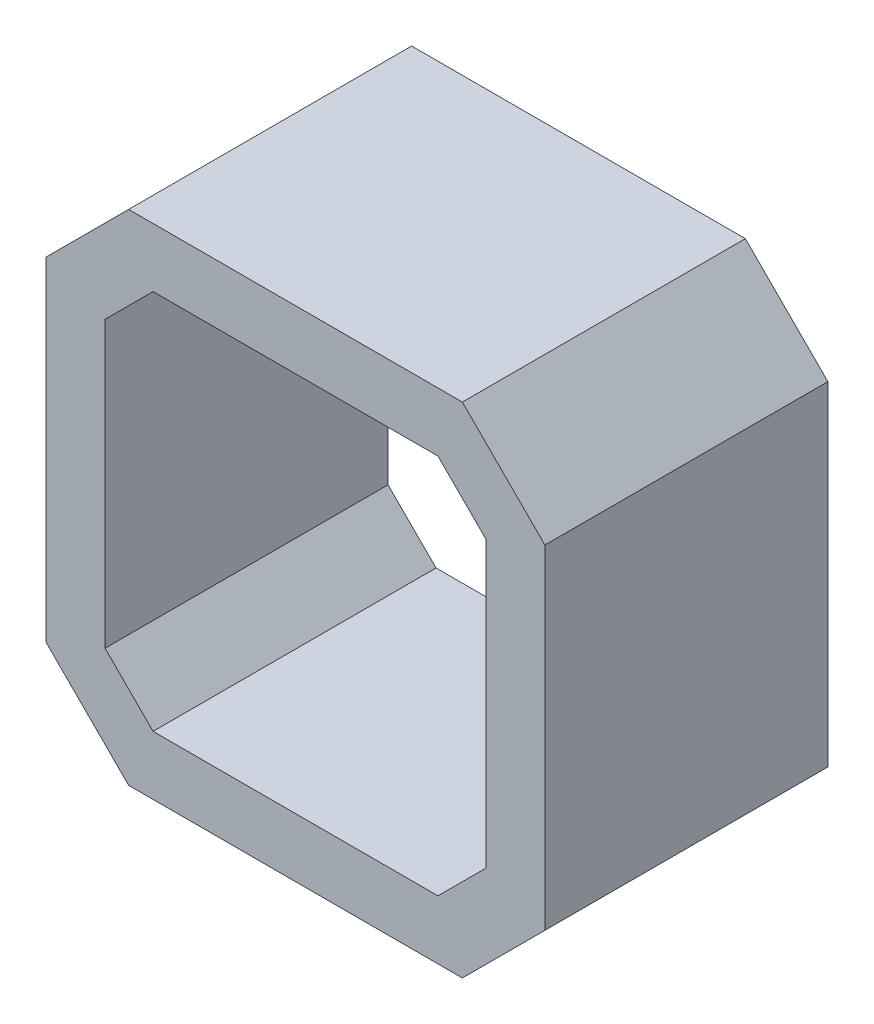
ISO-10303-21;
HEADER;
FILE_DESCRIPTION(('STEP AP214'),'2;1');
FILE_NAME('part.step','',(''),(''),'','','');
FILE_SCHEMA(('AUTOMOTIVE_DESIGN { 1 0 10303 214 1 1 1 1 }'));
ENDSEC;
DATA;
#1=APPLICATION_CONTEXT('core data for automotive mechanical design processes');
#2=APPLICATION_PROTOCOL_DEFINITION('international standard','automotive_design',2000,#1);
#3=PRODUCT_CONTEXT('',#1,'mechanical');
#4=PRODUCT('Part','Part','',(#3));
#5=PRODUCT_RELATED_PRODUCT_CATEGORY('part','',(#4));
#6=PRODUCT_DEFINITION_FORMATION('','',#4);
#7=PRODUCT_DEFINITION_CONTEXT('part definition',#1,'design');
#8=PRODUCT_DEFINITION('design','',#6,#7);
#9=PRODUCT_DEFINITION_SHAPE('','',#8);
#10=(LENGTH_UNIT() NAMED_UNIT(*) SI_UNIT(.MILLI.,.METRE.));
#11=(NAMED_UNIT(*) PLANE_ANGLE_UNIT() SI_UNIT($,.RADIAN.));
#12=(NAMED_UNIT(*) SI_UNIT($,.STERADIAN.) SOLID_ANGLE_UNIT());
#13=UNCERTAINTY_MEASURE_WITH_UNIT(LENGTH_MEASURE(1.E-05),#10,'distance_accuracy_value','');
#14=(GEOMETRIC_REPRESENTATION_CONTEXT(3) GLOBAL_UNCERTAINTY_ASSIGNED_CONTEXT((#13)) GLOBAL_UNIT_ASSIGNED_CONTEXT((#10,
#11,#12)) REPRESENTATION_CONTEXT('',''));
#15=CARTESIAN_POINT('',(0.,0.,0.));
#16=DIRECTION('',(0.,0.,1.));
#17=DIRECTION('',(1.,0.,0.));
#18=AXIS2_PLACEMENT_3D('',#15,#16,#17);
#19=CARTESIAN_POINT('',(0.,0.,12.));
#20=DIRECTION('',(0.,0.,-1.));
#21=DIRECTION('',(-1.,0.,0.));
#22=AXIS2_PLACEMENT_3D('',#19,#20,#21);
#23=PLANE('',#22);
#24=DIRECTION('',(-1.,0.,0.));
#25=VECTOR('',#24,1.);
#26=CARTESIAN_POINT('',(-14.15,21.15,12.));
#27=LINE('',#26,#25);
#28=CARTESIAN_POINT('',(14.15,21.15,12.));
#29=VERTEX_POINT('',#28);
#30=CARTESIAN_POINT('',(-14.15,21.15,12.));
#31=VERTEX_POINT('',#30);
#32=EDGE_CURVE('E210',#29,#31,#27,.T.);
#33=ORIENTED_EDGE('',*,*,#32,.T.);
#34=DIRECTION('',(-0.707106781186547,-0.707106781186547,0.));
#35=VECTOR('',#34,1.);
#36=CARTESIAN_POINT('',(-21.15,14.15,12.));
#37=LINE('',#36,#35);
#38=CARTESIAN_POINT('',(-21.15,14.15,12.));
#39=VERTEX_POINT('',#38);
#40=EDGE_CURVE('E213',#31,#39,#37,.T.);
#41=ORIENTED_EDGE('',*,*,#40,.T.);
#42=DIRECTION('',(0.,-1.,0.));
#43=VECTOR('',#42,1.);
#44=CARTESIAN_POINT('',(-21.15,14.15,12.));
#45=LINE('',#44,#43);
#46=CARTESIAN_POINT('',(-21.15,-14.15,12.));
#47=VERTEX_POINT('',#46);
#48=EDGE_CURVE('E216',#39,#47,#45,.T.);
#49=ORIENTED_EDGE('',*,*,#48,.T.);
#50=DIRECTION('',(0.707106781186547,-0.707106781186547,0.));
#51=VECTOR('',#50,1.);
#52=CARTESIAN_POINT('',(-21.15,-14.15,12.));
#53=LINE('',#52,#51);
#54=CARTESIAN_POINT('',(-14.15,-21.15,12.));
#55=VERTEX_POINT('',#54);
#56=EDGE_CURVE('E218',#47,#55,#53,.T.);
#57=ORIENTED_EDGE('',*,*,#56,.T.);
#58=DIRECTION('',(1.,0.,0.));
#59=VECTOR('',#58,1.);
#60=CARTESIAN_POINT('',(-14.15,-21.15,12.));
#61=LINE('',#60,#59);
#62=CARTESIAN_POINT('',(14.15,-21.15,12.));
#63=VERTEX_POINT('',#62);
#64=EDGE_CURVE('E220',#55,#63,#61,.T.);
#65=ORIENTED_EDGE('',*,*,#64,.T.);
#66=DIRECTION('',(0.707106781186547,0.707106781186547,0.));
#67=VECTOR('',#66,1.);
#68=CARTESIAN_POINT('',(14.15,-21.15,12.));
#69=LINE('',#68,#67);
#70=CARTESIAN_POINT('',(21.15,-14.15,12.));
#71=VERTEX_POINT('',#70);
#72=EDGE_CURVE('E222',#63,#71,#69,.T.);
#73=ORIENTED_EDGE('',*,*,#72,.T.);
#74=DIRECTION('',(0.,1.,0.));
#75=VECTOR('',#74,1.);
#76=CARTESIAN_POINT('',(21.15,14.15,12.));
#77=LINE('',#76,#75);
#78=CARTESIAN_POINT('',(21.15,14.15,12.));
#79=VERTEX_POINT('',#78);
#80=EDGE_CURVE('E224',#71,#79,#77,.T.);
#81=ORIENTED_EDGE('',*,*,#80,.T.);
#82=DIRECTION('',(-0.707106781186547,0.707106781186547,0.));
#83=VECTOR('',#82,1.);
#84=CARTESIAN_POINT('',(14.15,21.15,12.));
#85=LINE('',#84,#83);
#86=EDGE_CURVE('E226',#79,#29,#85,.T.);
#87=ORIENTED_EDGE('',*,*,#86,.T.);
#88=EDGE_LOOP('',(#33,#41,#49,#57,#65,#73,#81,#87));
#89=FACE_BOUND('',#88,.T.);
#90=DIRECTION('',(0.,-1.,0.));
#91=VECTOR('',#90,1.);
#92=CARTESIAN_POINT('',(-16.15,12.0789321881345,12.));
#93=LINE('',#92,#91);
#94=CARTESIAN_POINT('',(-16.15,12.0789321881345,12.));
#95=VERTEX_POINT('',#94);
#96=CARTESIAN_POINT('',(-16.15,-12.0789321881345,12.));
#97=VERTEX_POINT('',#96);
#98=EDGE_CURVE('E145',#95,#97,#93,.T.);
#99=ORIENTED_EDGE('',*,*,#98,.F.);
#100=DIRECTION('',(-0.707106781186547,-0.707106781186547,0.));
#101=VECTOR('',#100,1.);
#102=CARTESIAN_POINT('',(-16.15,12.0789321881345,12.));
#103=LINE('',#102,#101);
#104=CARTESIAN_POINT('',(-12.0789321881345,16.15,12.));
#105=VERTEX_POINT('',#104);
#106=EDGE_CURVE('E178',#105,#95,#103,.T.);
#107=ORIENTED_EDGE('',*,*,#106,.F.);
#108=DIRECTION('',(-1.,0.,0.));
#109=VECTOR('',#108,1.);
#110=CARTESIAN_POINT('',(-12.0789321881345,16.15,12.));
#111=LINE('',#110,#109);
#112=CARTESIAN_POINT('',(12.0789321881345,16.15,12.));
#113=VERTEX_POINT('',#112);
#114=EDGE_CURVE('E176',#113,#105,#111,.T.);
#115=ORIENTED_EDGE('',*,*,#114,.F.);
#116=DIRECTION('',(-0.707106781186547,0.707106781186547,0.));
#117=VECTOR('',#116,1.);
#118=CARTESIAN_POINT('',(12.0789321881345,16.15,12.));
#119=LINE('',#118,#117);
#120=CARTESIAN_POINT('',(16.15,12.0789321881345,12.));
#121=VERTEX_POINT('',#120);
#122=EDGE_CURVE('E174',#121,#113,#119,.T.);
#123=ORIENTED_EDGE('',*,*,#122,.F.);
#124=DIRECTION('',(0.,1.,0.));
#125=VECTOR('',#124,1.);
#126=CARTESIAN_POINT('',(16.15,12.0789321881345,12.));
#127=LINE('',#126,#125);
#128=CARTESIAN_POINT('',(16.15,-12.0789321881345,12.));
#129=VERTEX_POINT('',#128);
#130=EDGE_CURVE('E172',#129,#121,#127,.T.);
#131=ORIENTED_EDGE('',*,*,#130,.F.);
#132=DIRECTION('',(0.707106781186547,0.707106781186547,0.));
#133=VECTOR('',#132,1.);
#134=CARTESIAN_POINT('',(12.0789321881345,-16.15,12.));
#135=LINE('',#134,#133);
#136=CARTESIAN_POINT('',(12.0789321881345,-16.15,12.));
#137=VERTEX_POINT('',#136);
#138=EDGE_CURVE('E168',#137,#129,#135,.T.);
#139=ORIENTED_EDGE('',*,*,#138,.F.);
#140=DIRECTION('',(1.,0.,0.));
#141=VECTOR('',#140,1.);
#142=CARTESIAN_POINT('',(-12.0789321881345,-16.15,12.));
#143=LINE('',#142,#141);
#144=CARTESIAN_POINT('',(-12.0789321881345,-16.15,12.));
#145=VERTEX_POINT('',#144);
#146=EDGE_CURVE('E166',#145,#137,#143,.T.);
#147=ORIENTED_EDGE('',*,*,#146,.F.);
#148=DIRECTION('',(0.707106781186548,-0.707106781186547,0.));
#149=VECTOR('',#148,1.);
#150=CARTESIAN_POINT('',(-16.15,-12.0789321881345,12.));
#151=LINE('',#150,#149);
#152=EDGE_CURVE('E153',#97,#145,#151,.T.);
#153=ORIENTED_EDGE('',*,*,#152,.F.);
#154=EDGE_LOOP('',(#99,#107,#115,#123,#131,#139,#147,#153));
#155=FACE_BOUND('',#154,.T.);
#156=ADVANCED_FACE('F32',(#89,#155),#23,.F.);
#157=CARTESIAN_POINT('',(0.,0.,-12.));
#158=DIRECTION('',(0.,0.,-1.));
#159=DIRECTION('',(-1.,0.,0.));
#160=AXIS2_PLACEMENT_3D('',#157,#158,#159);
#161=PLANE('',#160);
#162=DIRECTION('',(-1.,0.,0.));
#163=VECTOR('',#162,1.);
#164=CARTESIAN_POINT('',(-14.15,21.15,-12.));
#165=LINE('',#164,#163);
#166=CARTESIAN_POINT('',(14.15,21.15,-12.));
#167=VERTEX_POINT('',#166);
#168=CARTESIAN_POINT('',(-14.15,21.15,-12.));
#169=VERTEX_POINT('',#168);
#170=EDGE_CURVE('E161',#167,#169,#165,.T.);
#171=ORIENTED_EDGE('',*,*,#170,.F.);
#172=DIRECTION('',(-0.707106781186547,0.707106781186547,0.));
#173=VECTOR('',#172,1.);
#174=CARTESIAN_POINT('',(14.15,21.15,-12.));
#175=LINE('',#174,#173);
#176=CARTESIAN_POINT('',(21.15,14.15,-12.));
#177=VERTEX_POINT('',#176);
#178=EDGE_CURVE('E214',#177,#167,#175,.T.);
#179=ORIENTED_EDGE('',*,*,#178,.F.);
#180=DIRECTION('',(0.,1.,0.));
#181=VECTOR('',#180,1.);
#182=CARTESIAN_POINT('',(21.15,14.15,-12.));
#183=LINE('',#182,#181);
#184=CARTESIAN_POINT('',(21.15,-14.15,-12.));
#185=VERTEX_POINT('',#184);
#186=EDGE_CURVE('E241',#185,#177,#183,.T.);
#187=ORIENTED_EDGE('',*,*,#186,.F.);
#188=DIRECTION('',(0.707106781186547,0.707106781186547,0.));
#189=VECTOR('',#188,1.);
#190=CARTESIAN_POINT('',(14.15,-21.15,-12.));
#191=LINE('',#190,#189);
#192=CARTESIAN_POINT('',(14.15,-21.15,-12.));
#193=VERTEX_POINT('',#192);
#194=EDGE_CURVE('E239',#193,#185,#191,.T.);
#195=ORIENTED_EDGE('',*,*,#194,.F.);
#196=DIRECTION('',(1.,0.,0.));
#197=VECTOR('',#196,1.);
#198=CARTESIAN_POINT('',(-14.15,-21.15,-12.));
#199=LINE('',#198,#197);
#200=CARTESIAN_POINT('',(-14.15,-21.15,-12.));
#201=VERTEX_POINT('',#200);
#202=EDGE_CURVE('E237',#201,#193,#199,.T.);
#203=ORIENTED_EDGE('',*,*,#202,.F.);
#204=DIRECTION('',(0.707106781186547,-0.707106781186547,0.));
#205=VECTOR('',#204,1.);
#206=CARTESIAN_POINT('',(-21.15,-14.15,-12.));
#207=LINE('',#206,#205);
#208=CARTESIAN_POINT('',(-21.15,-14.15,-12.));
#209=VERTEX_POINT('',#208);
#210=EDGE_CURVE('E235',#209,#201,#207,.T.);
#211=ORIENTED_EDGE('',*,*,#210,.F.);
#212=DIRECTION('',(0.,-1.,0.));
#213=VECTOR('',#212,1.);
#214=CARTESIAN_POINT('',(-21.15,14.15,-12.));
#215=LINE('',#214,#213);
#216=CARTESIAN_POINT('',(-21.15,14.15,-12.));
#217=VERTEX_POINT('',#216);
#218=EDGE_CURVE('E233',#217,#209,#215,.T.);
#219=ORIENTED_EDGE('',*,*,#218,.F.);
#220=DIRECTION('',(-0.707106781186547,-0.707106781186547,0.));
#221=VECTOR('',#220,1.);
#222=CARTESIAN_POINT('',(-21.15,14.15,-12.));
#223=LINE('',#222,#221);
#224=EDGE_CURVE('E231',#169,#217,#223,.T.);
#225=ORIENTED_EDGE('',*,*,#224,.F.);
#226=EDGE_LOOP('',(#171,#179,#187,#195,#203,#211,#219,#225));
#227=FACE_BOUND('',#226,.T.);
#228=DIRECTION('',(-0.707106781186547,-0.707106781186547,0.));
#229=VECTOR('',#228,1.);
#230=CARTESIAN_POINT('',(-16.15,12.0789321881345,-12.));
#231=LINE('',#230,#229);
#232=CARTESIAN_POINT('',(-12.0789321881345,16.15,-12.));
#233=VERTEX_POINT('',#232);
#234=CARTESIAN_POINT('',(-16.15,12.0789321881345,-12.));
#235=VERTEX_POINT('',#234);
#236=EDGE_CURVE('E154',#233,#235,#231,.T.);
#237=ORIENTED_EDGE('',*,*,#236,.T.);
#238=DIRECTION('',(0.,-1.,0.));
#239=VECTOR('',#238,1.);
#240=CARTESIAN_POINT('',(-16.15,12.0789321881345,-12.));
#241=LINE('',#240,#239);
#242=CARTESIAN_POINT('',(-16.15,-12.0789321881345,-12.));
#243=VERTEX_POINT('',#242);
#244=EDGE_CURVE('E55',#235,#243,#241,.T.);
#245=ORIENTED_EDGE('',*,*,#244,.T.);
#246=DIRECTION('',(0.707106781186548,-0.707106781186547,0.));
#247=VECTOR('',#246,1.);
#248=CARTESIAN_POINT('',(-16.15,-12.0789321881345,-12.));
#249=LINE('',#248,#247);
#250=CARTESIAN_POINT('',(-12.0789321881345,-16.15,-12.));
#251=VERTEX_POINT('',#250);
#252=EDGE_CURVE('E160',#243,#251,#249,.T.);
#253=ORIENTED_EDGE('',*,*,#252,.T.);
#254=DIRECTION('',(1.,0.,0.));
#255=VECTOR('',#254,1.);
#256=CARTESIAN_POINT('',(-12.0789321881345,-16.15,-12.));
#257=LINE('',#256,#255);
#258=CARTESIAN_POINT('',(12.0789321881345,-16.15,-12.));
#259=VERTEX_POINT('',#258);
#260=EDGE_CURVE('E182',#251,#259,#257,.T.);
#261=ORIENTED_EDGE('',*,*,#260,.T.);
#262=DIRECTION('',(0.707106781186547,0.707106781186547,0.));
#263=VECTOR('',#262,1.);
#264=CARTESIAN_POINT('',(12.0789321881345,-16.15,-12.));
#265=LINE('',#264,#263);
#266=CARTESIAN_POINT('',(16.15,-12.0789321881345,-12.));
#267=VERTEX_POINT('',#266);
#268=EDGE_CURVE('E185',#259,#267,#265,.T.);
#269=ORIENTED_EDGE('',*,*,#268,.T.);
#270=DIRECTION('',(0.,1.,0.));
#271=VECTOR('',#270,1.);
#272=CARTESIAN_POINT('',(16.15,12.0789321881345,-12.));
#273=LINE('',#272,#271);
#274=CARTESIAN_POINT('',(16.15,12.0789321881345,-12.));
#275=VERTEX_POINT('',#274);
#276=EDGE_CURVE('E188',#267,#275,#273,.T.);
#277=ORIENTED_EDGE('',*,*,#276,.T.);
#278=DIRECTION('',(-0.707106781186547,0.707106781186547,0.));
#279=VECTOR('',#278,1.);
#280=CARTESIAN_POINT('',(12.0789321881345,16.15,-12.));
#281=LINE('',#280,#279);
#282=CARTESIAN_POINT('',(12.0789321881345,16.15,-12.));
#283=VERTEX_POINT('',#282);
#284=EDGE_CURVE('E191',#275,#283,#281,.T.);
#285=ORIENTED_EDGE('',*,*,#284,.T.);
#286=DIRECTION('',(-1.,0.,0.));
#287=VECTOR('',#286,1.);
#288=CARTESIAN_POINT('',(-12.0789321881345,16.15,-12.));
#289=LINE('',#288,#287);
#290=EDGE_CURVE('E194',#283,#233,#289,.T.);
#291=ORIENTED_EDGE('',*,*,#290,.T.);
#292=EDGE_LOOP('',(#237,#245,#253,#261,#269,#277,#285,#291));
#293=FACE_BOUND('',#292,.T.);
#294=ADVANCED_FACE('F271',(#227,#293),#161,.T.);
#295=CARTESIAN_POINT('',(-14.15,21.15,12.));
#296=DIRECTION('',(0.,-1.,0.));
#297=DIRECTION('',(0.,0.,-1.));
#298=AXIS2_PLACEMENT_3D('',#295,#296,#297);
#299=PLANE('',#298);
#300=ORIENTED_EDGE('',*,*,#170,.T.);
#301=DIRECTION('',(0.,0.,-1.));
#302=VECTOR('',#301,1.);
#303=CARTESIAN_POINT('',(-14.15,21.15,12.));
#304=LINE('',#303,#302);
#305=EDGE_CURVE('E11',#31,#169,#304,.T.);
#306=ORIENTED_EDGE('',*,*,#305,.F.);
#307=ORIENTED_EDGE('',*,*,#32,.F.);
#308=DIRECTION('',(0.,0.,-1.));
#309=VECTOR('',#308,1.);
#310=CARTESIAN_POINT('',(14.15,21.15,12.));
#311=LINE('',#310,#309);
#312=EDGE_CURVE('E228',#29,#167,#311,.T.);
#313=ORIENTED_EDGE('',*,*,#312,.T.);
#314=EDGE_LOOP('',(#300,#306,#307,#313));
#315=FACE_BOUND('',#314,.T.);
#316=ADVANCED_FACE('F34',(#315),#299,.F.);
#317=CARTESIAN_POINT('',(-21.15,14.15,12.));
#318=DIRECTION('',(0.707106781186548,-0.707106781186548,0.));
#319=DIRECTION('',(0.707106781186548,0.707106781186548,0.));
#320=AXIS2_PLACEMENT_3D('',#317,#318,#319);
#321=PLANE('',#320);
#322=ORIENTED_EDGE('',*,*,#224,.T.);
#323=DIRECTION('',(0.,0.,-1.));
#324=VECTOR('',#323,1.);
#325=CARTESIAN_POINT('',(-21.15,14.15,12.));
#326=LINE('',#325,#324);
#327=EDGE_CURVE('E40',#39,#217,#326,.T.);
#328=ORIENTED_EDGE('',*,*,#327,.F.);
#329=ORIENTED_EDGE('',*,*,#40,.F.);
#330=ORIENTED_EDGE('',*,*,#305,.T.);
#331=EDGE_LOOP('',(#322,#328,#329,#330));
#332=FACE_BOUND('',#331,.T.);
#333=ADVANCED_FACE('F288',(#332),#321,.F.);
#334=CARTESIAN_POINT('',(-21.15,14.15,12.));
#335=DIRECTION('',(1.,0.,0.));
#336=DIRECTION('',(0.,1.,0.));
#337=AXIS2_PLACEMENT_3D('',#334,#335,#336);
#338=PLANE('',#337);
#339=ORIENTED_EDGE('',*,*,#218,.T.);
#340=DIRECTION('',(0.,0.,-1.));
#341=VECTOR('',#340,1.);
#342=CARTESIAN_POINT('',(-21.15,-14.15,12.));
#343=LINE('',#342,#341);
#344=EDGE_CURVE('E258',#47,#209,#343,.T.);
#345=ORIENTED_EDGE('',*,*,#344,.F.);
#346=ORIENTED_EDGE('',*,*,#48,.F.);
#347=ORIENTED_EDGE('',*,*,#327,.T.);
#348=EDGE_LOOP('',(#339,#345,#346,#347));
#349=FACE_BOUND('',#348,.T.);
#350=ADVANCED_FACE('F265',(#349),#338,.F.);
#351=CARTESIAN_POINT('',(-21.15,-14.15,12.));
#352=DIRECTION('',(0.707106781186548,0.707106781186548,0.));
#353=DIRECTION('',(-0.707106781186548,0.707106781186548,0.));
#354=AXIS2_PLACEMENT_3D('',#351,#352,#353);
#355=PLANE('',#354);
#356=ORIENTED_EDGE('',*,*,#210,.T.);
#357=DIRECTION('',(0.,0.,-1.));
#358=VECTOR('',#357,1.);
#359=CARTESIAN_POINT('',(-14.15,-21.15,12.));
#360=LINE('',#359,#358);
#361=EDGE_CURVE('E255',#55,#201,#360,.T.);
#362=ORIENTED_EDGE('',*,*,#361,.F.);
#363=ORIENTED_EDGE('',*,*,#56,.F.);
#364=ORIENTED_EDGE('',*,*,#344,.T.);
#365=EDGE_LOOP('',(#356,#362,#363,#364));
#366=FACE_BOUND('',#365,.T.);
#367=ADVANCED_FACE('F277',(#366),#355,.F.);
#368=CARTESIAN_POINT('',(-14.15,-21.15,12.));
#369=DIRECTION('',(0.,1.,0.));
#370=DIRECTION('',(0.,0.,1.));
#371=AXIS2_PLACEMENT_3D('',#368,#369,#370);
#372=PLANE('',#371);
#373=ORIENTED_EDGE('',*,*,#202,.T.);
#374=DIRECTION('',(0.,0.,-1.));
#375=VECTOR('',#374,1.);
#376=CARTESIAN_POINT('',(14.15,-21.15,12.));
#377=LINE('',#376,#375);
#378=EDGE_CURVE('E252',#63,#193,#377,.T.);
#379=ORIENTED_EDGE('',*,*,#378,.F.);
#380=ORIENTED_EDGE('',*,*,#64,.F.);
#381=ORIENTED_EDGE('',*,*,#361,.T.);
#382=EDGE_LOOP('',(#373,#379,#380,#381));
#383=FACE_BOUND('',#382,.T.);
#384=ADVANCED_FACE('F281',(#383),#372,.F.);
#385=CARTESIAN_POINT('',(14.15,-21.15,12.));
#386=DIRECTION('',(-0.707106781186548,0.707106781186548,0.));
#387=DIRECTION('',(-0.707106781186548,-0.707106781186548,0.));
#388=AXIS2_PLACEMENT_3D('',#385,#386,#387);
#389=PLANE('',#388);
#390=ORIENTED_EDGE('',*,*,#194,.T.);
#391=DIRECTION('',(0.,0.,-1.));
#392=VECTOR('',#391,1.);
#393=CARTESIAN_POINT('',(21.15,-14.15,12.));
#394=LINE('',#393,#392);
#395=EDGE_CURVE('E249',#71,#185,#394,.T.);
#396=ORIENTED_EDGE('',*,*,#395,.F.);
#397=ORIENTED_EDGE('',*,*,#72,.F.);
#398=ORIENTED_EDGE('',*,*,#378,.T.);
#399=EDGE_LOOP('',(#390,#396,#397,#398));
#400=FACE_BOUND('',#399,.T.);
#401=ADVANCED_FACE('F301',(#400),#389,.F.);
#402=CARTESIAN_POINT('',(21.15,14.15,12.));
#403=DIRECTION('',(-1.,0.,0.));
#404=DIRECTION('',(0.,-1.,0.));
#405=AXIS2_PLACEMENT_3D('',#402,#403,#404);
#406=PLANE('',#405);
#407=ORIENTED_EDGE('',*,*,#186,.T.);
#408=DIRECTION('',(0.,0.,-1.));
#409=VECTOR('',#408,1.);
#410=CARTESIAN_POINT('',(21.15,14.15,12.));
#411=LINE('',#410,#409);
#412=EDGE_CURVE('E246',#79,#177,#411,.T.);
#413=ORIENTED_EDGE('',*,*,#412,.F.);
#414=ORIENTED_EDGE('',*,*,#80,.F.);
#415=ORIENTED_EDGE('',*,*,#395,.T.);
#416=EDGE_LOOP('',(#407,#413,#414,#415));
#417=FACE_BOUND('',#416,.T.);
#418=ADVANCED_FACE('F299',(#417),#406,.F.);
#419=CARTESIAN_POINT('',(14.15,21.15,12.));
#420=DIRECTION('',(-0.707106781186548,-0.707106781186548,0.));
#421=DIRECTION('',(0.707106781186548,-0.707106781186548,0.));
#422=AXIS2_PLACEMENT_3D('',#419,#420,#421);
#423=PLANE('',#422);
#424=ORIENTED_EDGE('',*,*,#178,.T.);
#425=ORIENTED_EDGE('',*,*,#312,.F.);
#426=ORIENTED_EDGE('',*,*,#86,.F.);
#427=ORIENTED_EDGE('',*,*,#412,.T.);
#428=EDGE_LOOP('',(#424,#425,#426,#427));
#429=FACE_BOUND('',#428,.T.);
#430=ADVANCED_FACE('F294',(#429),#423,.F.);
#431=CARTESIAN_POINT('',(-16.15,12.0789321881345,12.));
#432=DIRECTION('',(1.,0.,0.));
#433=DIRECTION('',(0.,0.,-1.));
#434=AXIS2_PLACEMENT_3D('',#431,#432,#433);
#435=PLANE('',#434);
#436=ORIENTED_EDGE('',*,*,#244,.F.);
#437=DIRECTION('',(0.,0.,-1.));
#438=VECTOR('',#437,1.);
#439=CARTESIAN_POINT('',(-16.15,12.0789321881345,12.));
#440=LINE('',#439,#438);
#441=EDGE_CURVE('E149',#95,#235,#440,.T.);
#442=ORIENTED_EDGE('',*,*,#441,.F.);
#443=ORIENTED_EDGE('',*,*,#98,.T.);
#444=DIRECTION('',(0.,0.,-1.));
#445=VECTOR('',#444,1.);
#446=CARTESIAN_POINT('',(-16.15,-12.0789321881345,12.));
#447=LINE('',#446,#445);
#448=EDGE_CURVE('E148',#97,#243,#447,.T.);
#449=ORIENTED_EDGE('',*,*,#448,.T.);
#450=EDGE_LOOP('',(#436,#442,#443,#449));
#451=FACE_BOUND('',#450,.T.);
#452=ADVANCED_FACE('F147',(#451),#435,.T.);
#453=CARTESIAN_POINT('',(-16.15,-12.0789321881345,12.));
#454=DIRECTION('',(0.707106781186547,0.707106781186548,0.));
#455=DIRECTION('',(-0.707106781186548,0.707106781186547,0.));
#456=AXIS2_PLACEMENT_3D('',#453,#454,#455);
#457=PLANE('',#456);
#458=ORIENTED_EDGE('',*,*,#252,.F.);
#459=ORIENTED_EDGE('',*,*,#448,.F.);
#460=ORIENTED_EDGE('',*,*,#152,.T.);
#461=DIRECTION('',(0.,0.,-1.));
#462=VECTOR('',#461,1.);
#463=CARTESIAN_POINT('',(-12.0789321881345,-16.15,12.));
#464=LINE('',#463,#462);
#465=EDGE_CURVE('E162',#145,#251,#464,.T.);
#466=ORIENTED_EDGE('',*,*,#465,.T.);
#467=EDGE_LOOP('',(#458,#459,#460,#466));
#468=FACE_BOUND('',#467,.T.);
#469=ADVANCED_FACE('F157',(#468),#457,.T.);
#470=CARTESIAN_POINT('',(-12.0789321881345,-16.15,12.));
#471=DIRECTION('',(0.,1.,0.));
#472=DIRECTION('',(0.,0.,1.));
#473=AXIS2_PLACEMENT_3D('',#470,#471,#472);
#474=PLANE('',#473);
#475=ORIENTED_EDGE('',*,*,#260,.F.);
#476=ORIENTED_EDGE('',*,*,#465,.F.);
#477=ORIENTED_EDGE('',*,*,#146,.T.);
#478=DIRECTION('',(0.,0.,-1.));
#479=VECTOR('',#478,1.);
#480=CARTESIAN_POINT('',(12.0789321881345,-16.15,12.));
#481=LINE('',#480,#479);
#482=EDGE_CURVE('E207',#137,#259,#481,.T.);
#483=ORIENTED_EDGE('',*,*,#482,.T.);
#484=EDGE_LOOP('',(#475,#476,#477,#483));
#485=FACE_BOUND('',#484,.T.);
#486=ADVANCED_FACE('F326',(#485),#474,.T.);
#487=CARTESIAN_POINT('',(12.0789321881345,-16.15,12.));
#488=DIRECTION('',(-0.707106781186548,0.707106781186548,0.));
#489=DIRECTION('',(-0.707106781186548,-0.707106781186548,0.));
#490=AXIS2_PLACEMENT_3D('',#487,#488,#489);
#491=PLANE('',#490);
#492=ORIENTED_EDGE('',*,*,#268,.F.);
#493=ORIENTED_EDGE('',*,*,#482,.F.);
#494=ORIENTED_EDGE('',*,*,#138,.T.);
#495=DIRECTION('',(0.,0.,-1.));
#496=VECTOR('',#495,1.);
#497=CARTESIAN_POINT('',(16.15,-12.0789321881345,12.));
#498=LINE('',#497,#496);
#499=EDGE_CURVE('E205',#129,#267,#498,.T.);
#500=ORIENTED_EDGE('',*,*,#499,.T.);
#501=EDGE_LOOP('',(#492,#493,#494,#500));
#502=FACE_BOUND('',#501,.T.);
#503=ADVANCED_FACE('F330',(#502),#491,.T.);
#504=CARTESIAN_POINT('',(16.15,12.0789321881345,12.));
#505=DIRECTION('',(-1.,0.,0.));
#506=DIRECTION('',(0.,0.,1.));
#507=AXIS2_PLACEMENT_3D('',#504,#505,#506);
#508=PLANE('',#507);
#509=ORIENTED_EDGE('',*,*,#276,.F.);
#510=ORIENTED_EDGE('',*,*,#499,.F.);
#511=ORIENTED_EDGE('',*,*,#130,.T.);
#512=DIRECTION('',(0.,0.,-1.));
#513=VECTOR('',#512,1.);
#514=CARTESIAN_POINT('',(16.15,12.0789321881345,12.));
#515=LINE('',#514,#513);
#516=EDGE_CURVE('E203',#121,#275,#515,.T.);
#517=ORIENTED_EDGE('',*,*,#516,.T.);
#518=EDGE_LOOP('',(#509,#510,#511,#517));
#519=FACE_BOUND('',#518,.T.);
#520=ADVANCED_FACE('F336',(#519),#508,.T.);
#521=CARTESIAN_POINT('',(12.0789321881345,16.15,12.));
#522=DIRECTION('',(-0.707106781186548,-0.707106781186548,0.));
#523=DIRECTION('',(0.707106781186548,-0.707106781186548,0.));
#524=AXIS2_PLACEMENT_3D('',#521,#522,#523);
#525=PLANE('',#524);
#526=ORIENTED_EDGE('',*,*,#284,.F.);
#527=ORIENTED_EDGE('',*,*,#516,.F.);
#528=ORIENTED_EDGE('',*,*,#122,.T.);
#529=DIRECTION('',(0.,0.,-1.));
#530=VECTOR('',#529,1.);
#531=CARTESIAN_POINT('',(12.0789321881345,16.15,12.));
#532=LINE('',#531,#530);
#533=EDGE_CURVE('E201',#113,#283,#532,.T.);
#534=ORIENTED_EDGE('',*,*,#533,.T.);
#535=EDGE_LOOP('',(#526,#527,#528,#534));
#536=FACE_BOUND('',#535,.T.);
#537=ADVANCED_FACE('F340',(#536),#525,.T.);
#538=CARTESIAN_POINT('',(-12.0789321881345,16.15,12.));
#539=DIRECTION('',(0.,-1.,0.));
#540=DIRECTION('',(0.,0.,-1.));
#541=AXIS2_PLACEMENT_3D('',#538,#539,#540);
#542=PLANE('',#541);
#543=ORIENTED_EDGE('',*,*,#290,.F.);
#544=ORIENTED_EDGE('',*,*,#533,.F.);
#545=ORIENTED_EDGE('',*,*,#114,.T.);
#546=DIRECTION('',(0.,0.,-1.));
#547=VECTOR('',#546,1.);
#548=CARTESIAN_POINT('',(-12.0789321881345,16.15,12.));
#549=LINE('',#548,#547);
#550=EDGE_CURVE('E47',#105,#233,#549,.T.);
#551=ORIENTED_EDGE('',*,*,#550,.T.);
#552=EDGE_LOOP('',(#543,#544,#545,#551));
#553=FACE_BOUND('',#552,.T.);
#554=ADVANCED_FACE('F344',(#553),#542,.T.);
#555=CARTESIAN_POINT('',(-16.15,12.0789321881345,12.));
#556=DIRECTION('',(0.707106781186548,-0.707106781186548,0.));
#557=DIRECTION('',(0.707106781186548,0.707106781186548,0.));
#558=AXIS2_PLACEMENT_3D('',#555,#556,#557);
#559=PLANE('',#558);
#560=ORIENTED_EDGE('',*,*,#236,.F.);
#561=ORIENTED_EDGE('',*,*,#550,.F.);
#562=ORIENTED_EDGE('',*,*,#106,.T.);
#563=ORIENTED_EDGE('',*,*,#441,.T.);
#564=EDGE_LOOP('',(#560,#561,#562,#563));
#565=FACE_BOUND('',#564,.T.);
#566=ADVANCED_FACE('F348',(#565),#559,.T.);
#567=CLOSED_SHELL('',(#156,#294,#316,#333,#350,#367,#384,#401,#418,#430,#452,#469,#486,#503,
#520,#537,#554,#566));
#568=MANIFOLD_SOLID_BREP('B2',#567);
#569=ADVANCED_BREP_SHAPE_REPRESENTATION('',(#18,#568),#14);
#570=SHAPE_DEFINITION_REPRESENTATION(#9,#569);
ENDSEC;
END-ISO-10303-21;
